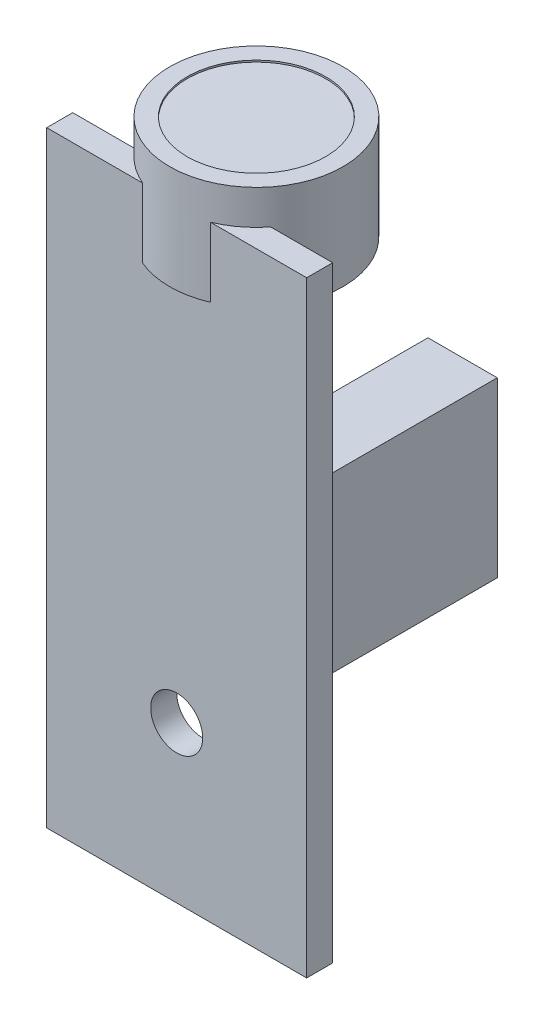
ISO-10303-21;
HEADER;
FILE_DESCRIPTION(('STEP AP214'),'2;1');
FILE_NAME('part.step','',(''),(''),'','','');
FILE_SCHEMA(('AUTOMOTIVE_DESIGN { 1 0 10303 214 1 1 1 1 }'));
ENDSEC;
DATA;
#1=APPLICATION_CONTEXT('core data for automotive mechanical design processes');
#2=APPLICATION_PROTOCOL_DEFINITION('international standard','automotive_design',2000,#1);
#3=PRODUCT_CONTEXT('',#1,'mechanical');
#4=PRODUCT('Part','Part','',(#3));
#5=PRODUCT_RELATED_PRODUCT_CATEGORY('part','',(#4));
#6=PRODUCT_DEFINITION_FORMATION('','',#4);
#7=PRODUCT_DEFINITION_CONTEXT('part definition',#1,'design');
#8=PRODUCT_DEFINITION('design','',#6,#7);
#9=PRODUCT_DEFINITION_SHAPE('','',#8);
#10=(LENGTH_UNIT() NAMED_UNIT(*) SI_UNIT(.MILLI.,.METRE.));
#11=(NAMED_UNIT(*) PLANE_ANGLE_UNIT() SI_UNIT($,.RADIAN.));
#12=(NAMED_UNIT(*) SI_UNIT($,.STERADIAN.) SOLID_ANGLE_UNIT());
#13=UNCERTAINTY_MEASURE_WITH_UNIT(LENGTH_MEASURE(1.E-05),#10,'distance_accuracy_value','');
#14=(GEOMETRIC_REPRESENTATION_CONTEXT(3) GLOBAL_UNCERTAINTY_ASSIGNED_CONTEXT((#13)) GLOBAL_UNIT_ASSIGNED_CONTEXT((#10,
#11,#12)) REPRESENTATION_CONTEXT('',''));
#15=CARTESIAN_POINT('',(0.,0.,0.));
#16=DIRECTION('',(0.,0.,1.));
#17=DIRECTION('',(1.,0.,0.));
#18=AXIS2_PLACEMENT_3D('',#15,#16,#17);
#19=CARTESIAN_POINT('',(0.,0.,0.));
#20=DIRECTION('',(0.,0.,-1.));
#21=DIRECTION('',(-1.,0.,0.));
#22=AXIS2_PLACEMENT_3D('',#19,#20,#21);
#23=PLANE('',#22);
#24=DIRECTION('',(0.,1.,0.));
#25=VECTOR('',#24,1.);
#26=CARTESIAN_POINT('',(216.212225932465,165.394136477233,0.));
#27=LINE('',#26,#25);
#28=CARTESIAN_POINT('',(216.212225932465,165.394136477233,0.));
#29=VERTEX_POINT('',#28);
#30=CARTESIAN_POINT('',(216.212225932465,169.394136477233,0.));
#31=VERTEX_POINT('',#30);
#32=EDGE_CURVE('E55',#29,#31,#27,.T.);
#33=ORIENTED_EDGE('',*,*,#32,.F.);
#34=DIRECTION('',(1.,0.,0.));
#35=VECTOR('',#34,1.);
#36=CARTESIAN_POINT('',(0.,165.394136477233,0.));
#37=LINE('',#36,#35);
#38=CARTESIAN_POINT('',(224.058244030838,165.394136477233,0.));
#39=VERTEX_POINT('',#38);
#40=EDGE_CURVE('E11',#29,#39,#37,.T.);
#41=ORIENTED_EDGE('',*,*,#40,.T.);
#42=DIRECTION('',(0.,1.,0.));
#43=VECTOR('',#42,1.);
#44=CARTESIAN_POINT('',(224.058244030838,165.394136477233,0.));
#45=LINE('',#44,#43);
#46=CARTESIAN_POINT('',(224.058244030838,169.394136477233,0.));
#47=VERTEX_POINT('',#46);
#48=EDGE_CURVE('E168',#47,#39,#45,.F.);
#49=ORIENTED_EDGE('',*,*,#48,.F.);
#50=DIRECTION('',(-1.,0.,0.));
#51=VECTOR('',#50,1.);
#52=CARTESIAN_POINT('',(212.635234981651,169.394136477233,0.));
#53=LINE('',#52,#51);
#54=CARTESIAN_POINT('',(227.635234981651,169.394136477233,0.));
#55=VERTEX_POINT('',#54);
#56=EDGE_CURVE('E186',#55,#47,#53,.T.);
#57=ORIENTED_EDGE('',*,*,#56,.F.);
#58=DIRECTION('',(0.,1.,0.));
#59=VECTOR('',#58,1.);
#60=CARTESIAN_POINT('',(227.635234981651,134.394136477233,0.));
#61=LINE('',#60,#59);
#62=CARTESIAN_POINT('',(227.635234981651,134.394136477233,0.));
#63=VERTEX_POINT('',#62);
#64=EDGE_CURVE('E199',#63,#55,#61,.T.);
#65=ORIENTED_EDGE('',*,*,#64,.F.);
#66=DIRECTION('',(1.,0.,0.));
#67=VECTOR('',#66,1.);
#68=CARTESIAN_POINT('',(212.635234981651,134.394136477233,0.));
#69=LINE('',#68,#67);
#70=CARTESIAN_POINT('',(212.635234981651,134.394136477233,0.));
#71=VERTEX_POINT('',#70);
#72=EDGE_CURVE('E197',#71,#63,#69,.T.);
#73=ORIENTED_EDGE('',*,*,#72,.F.);
#74=DIRECTION('',(0.,-1.,0.));
#75=VECTOR('',#74,1.);
#76=CARTESIAN_POINT('',(212.635234981651,134.394136477233,0.));
#77=LINE('',#76,#75);
#78=CARTESIAN_POINT('',(212.635234981651,169.394136477233,0.));
#79=VERTEX_POINT('',#78);
#80=EDGE_CURVE('E179',#79,#71,#77,.T.);
#81=ORIENTED_EDGE('',*,*,#80,.F.);
#82=EDGE_CURVE('E201',#31,#79,#53,.T.);
#83=ORIENTED_EDGE('',*,*,#82,.F.);
#84=EDGE_LOOP('',(#33,#41,#49,#57,#65,#73,#81,#83));
#85=FACE_BOUND('',#84,.T.);
#86=CARTESIAN_POINT('',(220.135234981651,143.394136477233,0.));
#87=DIRECTION('',(0.,0.,1.));
#88=DIRECTION('',(1.,0.,0.));
#89=AXIS2_PLACEMENT_3D('',#86,#87,#88);
#90=CIRCLE('',#89,1.5);
#91=CARTESIAN_POINT('',(221.635234981651,143.394136477233,0.));
#92=VERTEX_POINT('',#91);
#93=EDGE_CURVE('E175',#92,#92,#90,.T.);
#94=ORIENTED_EDGE('',*,*,#93,.T.);
#95=EDGE_LOOP('',(#94));
#96=FACE_BOUND('',#95,.T.);
#97=DIRECTION('',(-1.,0.,0.));
#98=VECTOR('',#97,1.);
#99=CARTESIAN_POINT('',(227.135234981651,148.394136477233,0.));
#100=LINE('',#99,#98);
#101=CARTESIAN_POINT('',(227.135234981651,148.394136477233,0.));
#102=VERTEX_POINT('',#101);
#103=CARTESIAN_POINT('',(223.135234981651,148.394136477233,0.));
#104=VERTEX_POINT('',#103);
#105=EDGE_CURVE('E418',#102,#104,#100,.T.);
#106=ORIENTED_EDGE('',*,*,#105,.F.);
#107=DIRECTION('',(0.,-1.,0.));
#108=VECTOR('',#107,1.);
#109=CARTESIAN_POINT('',(227.135234981651,158.394136477233,0.));
#110=LINE('',#109,#108);
#111=CARTESIAN_POINT('',(227.135234981651,158.394136477233,0.));
#112=VERTEX_POINT('',#111);
#113=EDGE_CURVE('E145',#112,#102,#110,.T.);
#114=ORIENTED_EDGE('',*,*,#113,.F.);
#115=DIRECTION('',(1.,0.,0.));
#116=VECTOR('',#115,1.);
#117=CARTESIAN_POINT('',(227.135234981651,158.394136477233,0.));
#118=LINE('',#117,#116);
#119=CARTESIAN_POINT('',(223.135234981651,158.394136477233,0.));
#120=VERTEX_POINT('',#119);
#121=EDGE_CURVE('E141',#120,#112,#118,.T.);
#122=ORIENTED_EDGE('',*,*,#121,.F.);
#123=DIRECTION('',(0.,1.,0.));
#124=VECTOR('',#123,1.);
#125=CARTESIAN_POINT('',(223.135234981651,158.394136477233,0.));
#126=LINE('',#125,#124);
#127=EDGE_CURVE('E415',#104,#120,#126,.T.);
#128=ORIENTED_EDGE('',*,*,#127,.F.);
#129=EDGE_LOOP('',(#106,#114,#122,#128));
#130=FACE_BOUND('',#129,.T.);
#131=ADVANCED_FACE('F32',(#85,#96,#130),#23,.T.);
#132=CARTESIAN_POINT('',(212.635234981651,169.394136477233,1.5));
#133=DIRECTION('',(0.,-1.,0.));
#134=DIRECTION('',(0.,0.,-1.));
#135=AXIS2_PLACEMENT_3D('',#132,#133,#134);
#136=PLANE('',#135);
#137=ORIENTED_EDGE('',*,*,#56,.T.);
#138=CARTESIAN_POINT('',(220.135234981651,169.394136477233,-3.1));
#139=DIRECTION('',(0.,-1.,0.));
#140=DIRECTION('',(0.,0.,-1.));
#141=AXIS2_PLACEMENT_3D('',#138,#139,#140);
#142=CIRCLE('',#141,4.99999999999999);
#143=CARTESIAN_POINT('',(222.094826775878,169.394136477233,1.5));
#144=VERTEX_POINT('',#143);
#145=EDGE_CURVE('E40',#47,#144,#142,.T.);
#146=ORIENTED_EDGE('',*,*,#145,.T.);
#147=DIRECTION('',(-1.,0.,0.));
#148=VECTOR('',#147,1.);
#149=CARTESIAN_POINT('',(212.635234981651,169.394136477233,1.5));
#150=LINE('',#149,#148);
#151=CARTESIAN_POINT('',(227.635234981651,169.394136477233,1.5));
#152=VERTEX_POINT('',#151);
#153=EDGE_CURVE('E191',#152,#144,#150,.T.);
#154=ORIENTED_EDGE('',*,*,#153,.F.);
#155=DIRECTION('',(0.,0.,-1.));
#156=VECTOR('',#155,1.);
#157=CARTESIAN_POINT('',(227.635234981651,169.394136477233,1.5));
#158=LINE('',#157,#156);
#159=EDGE_CURVE('E206',#152,#55,#158,.T.);
#160=ORIENTED_EDGE('',*,*,#159,.T.);
#161=EDGE_LOOP('',(#137,#146,#154,#160));
#162=FACE_BOUND('',#161,.T.);
#163=ADVANCED_FACE('F221',(#162),#136,.F.);
#164=CARTESIAN_POINT('',(0.,0.,1.5));
#165=DIRECTION('',(0.,0.,-1.));
#166=DIRECTION('',(-1.,0.,0.));
#167=AXIS2_PLACEMENT_3D('',#164,#165,#166);
#168=PLANE('',#167);
#169=DIRECTION('',(1.,0.,0.));
#170=VECTOR('',#169,1.);
#171=CARTESIAN_POINT('',(0.,165.394136477233,1.5));
#172=LINE('',#171,#170);
#173=CARTESIAN_POINT('',(218.175643187425,165.394136477233,1.5));
#174=VERTEX_POINT('',#173);
#175=CARTESIAN_POINT('',(222.094826775878,165.394136477233,1.5));
#176=VERTEX_POINT('',#175);
#177=EDGE_CURVE('E173',#174,#176,#172,.T.);
#178=ORIENTED_EDGE('',*,*,#177,.F.);
#179=DIRECTION('',(0.,1.,0.));
#180=VECTOR('',#179,1.);
#181=CARTESIAN_POINT('',(218.175643187425,165.394136477233,1.5));
#182=LINE('',#181,#180);
#183=CARTESIAN_POINT('',(218.175643187425,169.394136477233,1.5));
#184=VERTEX_POINT('',#183);
#185=EDGE_CURVE('E165',#174,#184,#182,.T.);
#186=ORIENTED_EDGE('',*,*,#185,.T.);
#187=CARTESIAN_POINT('',(212.635234981651,169.394136477233,1.5));
#188=VERTEX_POINT('',#187);
#189=EDGE_CURVE('E190',#184,#188,#150,.T.);
#190=ORIENTED_EDGE('',*,*,#189,.T.);
#191=DIRECTION('',(0.,-1.,0.));
#192=VECTOR('',#191,1.);
#193=CARTESIAN_POINT('',(212.635234981651,134.394136477233,1.5));
#194=LINE('',#193,#192);
#195=CARTESIAN_POINT('',(212.635234981651,134.394136477233,1.5));
#196=VERTEX_POINT('',#195);
#197=EDGE_CURVE('E182',#188,#196,#194,.T.);
#198=ORIENTED_EDGE('',*,*,#197,.T.);
#199=DIRECTION('',(1.,0.,0.));
#200=VECTOR('',#199,1.);
#201=CARTESIAN_POINT('',(212.635234981651,134.394136477233,1.5));
#202=LINE('',#201,#200);
#203=CARTESIAN_POINT('',(227.635234981651,134.394136477233,1.5));
#204=VERTEX_POINT('',#203);
#205=EDGE_CURVE('E185',#196,#204,#202,.T.);
#206=ORIENTED_EDGE('',*,*,#205,.T.);
#207=DIRECTION('',(0.,1.,0.));
#208=VECTOR('',#207,1.);
#209=CARTESIAN_POINT('',(227.635234981651,134.394136477233,1.5));
#210=LINE('',#209,#208);
#211=EDGE_CURVE('E188',#204,#152,#210,.T.);
#212=ORIENTED_EDGE('',*,*,#211,.T.);
#213=ORIENTED_EDGE('',*,*,#153,.T.);
#214=DIRECTION('',(0.,1.,0.));
#215=VECTOR('',#214,1.);
#216=CARTESIAN_POINT('',(222.094826775878,165.394136477233,1.5));
#217=LINE('',#216,#215);
#218=EDGE_CURVE('E170',#144,#176,#217,.F.);
#219=ORIENTED_EDGE('',*,*,#218,.T.);
#220=EDGE_LOOP('',(#178,#186,#190,#198,#206,#212,#213,#219));
#221=FACE_BOUND('',#220,.T.);
#222=CARTESIAN_POINT('',(220.135234981651,143.394136477233,1.5));
#223=DIRECTION('',(0.,0.,1.));
#224=DIRECTION('',(1.,0.,0.));
#225=AXIS2_PLACEMENT_3D('',#222,#223,#224);
#226=CIRCLE('',#225,1.5);
#227=CARTESIAN_POINT('',(221.635234981651,143.394136477233,1.5));
#228=VERTEX_POINT('',#227);
#229=EDGE_CURVE('E176',#228,#228,#226,.T.);
#230=ORIENTED_EDGE('',*,*,#229,.F.);
#231=EDGE_LOOP('',(#230));
#232=FACE_BOUND('',#231,.T.);
#233=ADVANCED_FACE('F226',(#221,#232),#168,.F.);
#234=CARTESIAN_POINT('',(212.635234981651,134.394136477233,1.5));
#235=DIRECTION('',(1.,0.,0.));
#236=DIRECTION('',(0.,0.,-1.));
#237=AXIS2_PLACEMENT_3D('',#234,#235,#236);
#238=PLANE('',#237);
#239=ORIENTED_EDGE('',*,*,#80,.T.);
#240=DIRECTION('',(0.,0.,-1.));
#241=VECTOR('',#240,1.);
#242=CARTESIAN_POINT('',(212.635234981651,134.394136477233,1.5));
#243=LINE('',#242,#241);
#244=EDGE_CURVE('E212',#196,#71,#243,.T.);
#245=ORIENTED_EDGE('',*,*,#244,.F.);
#246=ORIENTED_EDGE('',*,*,#197,.F.);
#247=DIRECTION('',(0.,0.,-1.));
#248=VECTOR('',#247,1.);
#249=CARTESIAN_POINT('',(212.635234981651,169.394136477233,1.5));
#250=LINE('',#249,#248);
#251=EDGE_CURVE('E194',#188,#79,#250,.T.);
#252=ORIENTED_EDGE('',*,*,#251,.T.);
#253=EDGE_LOOP('',(#239,#245,#246,#252));
#254=FACE_BOUND('',#253,.T.);
#255=ADVANCED_FACE('F34',(#254),#238,.F.);
#256=CARTESIAN_POINT('',(212.635234981651,134.394136477233,1.5));
#257=DIRECTION('',(0.,1.,0.));
#258=DIRECTION('',(0.,0.,1.));
#259=AXIS2_PLACEMENT_3D('',#256,#257,#258);
#260=PLANE('',#259);
#261=ORIENTED_EDGE('',*,*,#72,.T.);
#262=DIRECTION('',(0.,0.,-1.));
#263=VECTOR('',#262,1.);
#264=CARTESIAN_POINT('',(227.635234981651,134.394136477233,1.5));
#265=LINE('',#264,#263);
#266=EDGE_CURVE('E209',#204,#63,#265,.T.);
#267=ORIENTED_EDGE('',*,*,#266,.F.);
#268=ORIENTED_EDGE('',*,*,#205,.F.);
#269=ORIENTED_EDGE('',*,*,#244,.T.);
#270=EDGE_LOOP('',(#261,#267,#268,#269));
#271=FACE_BOUND('',#270,.T.);
#272=ADVANCED_FACE('F268',(#271),#260,.F.);
#273=CARTESIAN_POINT('',(227.635234981651,134.394136477233,1.5));
#274=DIRECTION('',(-1.,0.,0.));
#275=DIRECTION('',(0.,0.,1.));
#276=AXIS2_PLACEMENT_3D('',#273,#274,#275);
#277=PLANE('',#276);
#278=ORIENTED_EDGE('',*,*,#64,.T.);
#279=ORIENTED_EDGE('',*,*,#159,.F.);
#280=ORIENTED_EDGE('',*,*,#211,.F.);
#281=ORIENTED_EDGE('',*,*,#266,.T.);
#282=EDGE_LOOP('',(#278,#279,#280,#281));
#283=FACE_BOUND('',#282,.T.);
#284=ADVANCED_FACE('F232',(#283),#277,.F.);
#285=ORIENTED_EDGE('',*,*,#189,.F.);
#286=EDGE_CURVE('E214',#184,#31,#142,.T.);
#287=ORIENTED_EDGE('',*,*,#286,.T.);
#288=ORIENTED_EDGE('',*,*,#82,.T.);
#289=ORIENTED_EDGE('',*,*,#251,.F.);
#290=EDGE_LOOP('',(#285,#287,#288,#289));
#291=FACE_BOUND('',#290,.T.);
#292=ADVANCED_FACE('F262',(#291),#136,.F.);
#293=CARTESIAN_POINT('',(220.135234981651,143.394136477233,1.5));
#294=DIRECTION('',(0.,0.,-1.));
#295=DIRECTION('',(-1.,0.,0.));
#296=AXIS2_PLACEMENT_3D('',#293,#294,#295);
#297=CYLINDRICAL_SURFACE('',#296,1.5);
#298=ORIENTED_EDGE('',*,*,#229,.T.);
#299=EDGE_LOOP('',(#298));
#300=FACE_BOUND('',#299,.T.);
#301=ORIENTED_EDGE('',*,*,#93,.F.);
#302=EDGE_LOOP('',(#301));
#303=FACE_BOUND('',#302,.T.);
#304=ADVANCED_FACE('F254',(#300,#303),#297,.F.);
#305=CARTESIAN_POINT('',(220.135234981651,165.394136477233,-3.1));
#306=DIRECTION('',(0.,1.,0.));
#307=DIRECTION('',(0.,0.,1.));
#308=AXIS2_PLACEMENT_3D('',#305,#306,#307);
#309=PLANE('',#308);
#310=CARTESIAN_POINT('',(220.135234981651,165.394136477233,-3.1));
#311=DIRECTION('',(0.,1.,0.));
#312=DIRECTION('',(0.,0.,1.));
#313=AXIS2_PLACEMENT_3D('',#310,#311,#312);
#314=CIRCLE('',#313,4.99999999999999);
#315=EDGE_CURVE('E160',#174,#176,#314,.T.);
#316=ORIENTED_EDGE('',*,*,#315,.F.);
#317=ORIENTED_EDGE('',*,*,#177,.T.);
#318=EDGE_LOOP('',(#316,#317));
#319=FACE_BOUND('',#318,.T.);
#320=ADVANCED_FACE('F243',(#319),#309,.F.);
#321=CARTESIAN_POINT('',(220.135234981651,165.394136477233,-3.1));
#322=DIRECTION('',(0.,1.,0.));
#323=DIRECTION('',(0.,0.,1.));
#324=AXIS2_PLACEMENT_3D('',#321,#322,#323);
#325=CYLINDRICAL_SURFACE('',#324,4.99999999999999);
#326=CARTESIAN_POINT('',(220.135234981651,171.394136477233,-3.1));
#327=DIRECTION('',(0.,1.,0.));
#328=DIRECTION('',(0.,0.,1.));
#329=AXIS2_PLACEMENT_3D('',#326,#327,#328);
#330=CIRCLE('',#329,4.99999999999999);
#331=CARTESIAN_POINT('',(220.135234981651,171.394136477233,1.89999999999999));
#332=VERTEX_POINT('',#331);
#333=EDGE_CURVE('E156',#332,#332,#330,.T.);
#334=ORIENTED_EDGE('',*,*,#333,.F.);
#335=EDGE_LOOP('',(#334));
#336=FACE_BOUND('',#335,.T.);
#337=ORIENTED_EDGE('',*,*,#218,.F.);
#338=ORIENTED_EDGE('',*,*,#145,.F.);
#339=ORIENTED_EDGE('',*,*,#48,.T.);
#340=EDGE_CURVE('E163',#39,#29,#314,.T.);
#341=ORIENTED_EDGE('',*,*,#340,.T.);
#342=ORIENTED_EDGE('',*,*,#32,.T.);
#343=ORIENTED_EDGE('',*,*,#286,.F.);
#344=ORIENTED_EDGE('',*,*,#185,.F.);
#345=ORIENTED_EDGE('',*,*,#315,.T.);
#346=EDGE_LOOP('',(#337,#338,#339,#341,#342,#343,#344,#345));
#347=FACE_BOUND('',#346,.T.);
#348=ADVANCED_FACE('F237',(#336,#347),#325,.T.);
#349=ORIENTED_EDGE('',*,*,#40,.F.);
#350=ORIENTED_EDGE('',*,*,#340,.F.);
#351=EDGE_LOOP('',(#349,#350));
#352=FACE_BOUND('',#351,.T.);
#353=ADVANCED_FACE('F239',(#352),#309,.F.);
#354=CARTESIAN_POINT('',(220.135234981651,171.394136477233,-3.1));
#355=DIRECTION('',(0.,1.,0.));
#356=DIRECTION('',(0.,0.,1.));
#357=AXIS2_PLACEMENT_3D('',#354,#355,#356);
#358=PLANE('',#357);
#359=CARTESIAN_POINT('',(220.135234981651,171.394136477233,-3.1));
#360=DIRECTION('',(0.,1.,0.));
#361=DIRECTION('',(0.,0.,1.));
#362=AXIS2_PLACEMENT_3D('',#359,#360,#361);
#363=CIRCLE('',#362,3.99999999999999);
#364=CARTESIAN_POINT('',(220.135234981651,171.394136477233,0.899999999999992));
#365=VERTEX_POINT('',#364);
#366=EDGE_CURVE('E147',#365,#365,#363,.T.);
#367=ORIENTED_EDGE('',*,*,#366,.F.);
#368=EDGE_LOOP('',(#367));
#369=FACE_BOUND('',#368,.T.);
#370=ORIENTED_EDGE('',*,*,#333,.T.);
#371=EDGE_LOOP('',(#370));
#372=FACE_BOUND('',#371,.T.);
#373=ADVANCED_FACE('F241',(#369,#372),#358,.T.);
#374=CARTESIAN_POINT('',(220.135234981651,171.294136477233,-3.1));
#375=DIRECTION('',(0.,1.,0.));
#376=DIRECTION('',(0.,0.,1.));
#377=AXIS2_PLACEMENT_3D('',#374,#375,#376);
#378=CYLINDRICAL_SURFACE('',#377,3.99999999999999);
#379=CARTESIAN_POINT('',(220.135234981651,171.294136477233,-3.1));
#380=DIRECTION('',(0.,1.,0.));
#381=DIRECTION('',(0.,0.,1.));
#382=AXIS2_PLACEMENT_3D('',#379,#380,#381);
#383=CIRCLE('',#382,3.99999999999999);
#384=CARTESIAN_POINT('',(220.135234981651,171.294136477233,0.899999999999992));
#385=VERTEX_POINT('',#384);
#386=EDGE_CURVE('E150',#385,#385,#383,.T.);
#387=ORIENTED_EDGE('',*,*,#386,.F.);
#388=EDGE_LOOP('',(#387));
#389=FACE_BOUND('',#388,.T.);
#390=ORIENTED_EDGE('',*,*,#366,.T.);
#391=EDGE_LOOP('',(#390));
#392=FACE_BOUND('',#391,.T.);
#393=ADVANCED_FACE('F248',(#389,#392),#378,.F.);
#394=CARTESIAN_POINT('',(220.135234981651,171.294136477233,-3.1));
#395=DIRECTION('',(0.,1.,0.));
#396=DIRECTION('',(0.,0.,1.));
#397=AXIS2_PLACEMENT_3D('',#394,#395,#396);
#398=PLANE('',#397);
#399=ORIENTED_EDGE('',*,*,#386,.T.);
#400=EDGE_LOOP('',(#399));
#401=FACE_BOUND('',#400,.T.);
#402=ADVANCED_FACE('F350',(#401),#398,.T.);
#403=CARTESIAN_POINT('',(227.135234981651,158.394136477233,-10.));
#404=DIRECTION('',(-1.,0.,0.));
#405=DIRECTION('',(0.,0.,1.));
#406=AXIS2_PLACEMENT_3D('',#403,#404,#405);
#407=PLANE('',#406);
#408=ORIENTED_EDGE('',*,*,#113,.T.);
#409=DIRECTION('',(0.,0.,1.));
#410=VECTOR('',#409,1.);
#411=CARTESIAN_POINT('',(227.135234981651,148.394136477233,-10.));
#412=LINE('',#411,#410);
#413=CARTESIAN_POINT('',(227.135234981651,148.394136477233,-10.));
#414=VERTEX_POINT('',#413);
#415=EDGE_CURVE('E126',#414,#102,#412,.T.);
#416=ORIENTED_EDGE('',*,*,#415,.F.);
#417=DIRECTION('',(0.,-1.,0.));
#418=VECTOR('',#417,1.);
#419=CARTESIAN_POINT('',(227.135234981651,158.394136477233,-10.));
#420=LINE('',#419,#418);
#421=CARTESIAN_POINT('',(227.135234981651,158.394136477233,-10.));
#422=VERTEX_POINT('',#421);
#423=EDGE_CURVE('E133',#422,#414,#420,.T.);
#424=ORIENTED_EDGE('',*,*,#423,.F.);
#425=DIRECTION('',(0.,0.,1.));
#426=VECTOR('',#425,1.);
#427=CARTESIAN_POINT('',(227.135234981651,158.394136477233,-10.));
#428=LINE('',#427,#426);
#429=EDGE_CURVE('E412',#422,#112,#428,.T.);
#430=ORIENTED_EDGE('',*,*,#429,.T.);
#431=EDGE_LOOP('',(#408,#416,#424,#430));
#432=FACE_BOUND('',#431,.T.);
#433=ADVANCED_FACE('F143',(#432),#407,.F.);
#434=CARTESIAN_POINT('',(227.135234981651,148.394136477233,-10.));
#435=DIRECTION('',(0.,1.,0.));
#436=DIRECTION('',(0.,0.,1.));
#437=AXIS2_PLACEMENT_3D('',#434,#435,#436);
#438=PLANE('',#437);
#439=ORIENTED_EDGE('',*,*,#105,.T.);
#440=DIRECTION('',(0.,0.,1.));
#441=VECTOR('',#440,1.);
#442=CARTESIAN_POINT('',(223.135234981651,148.394136477233,-10.));
#443=LINE('',#442,#441);
#444=CARTESIAN_POINT('',(223.135234981651,148.394136477233,-10.));
#445=VERTEX_POINT('',#444);
#446=EDGE_CURVE('E129',#445,#104,#443,.T.);
#447=ORIENTED_EDGE('',*,*,#446,.F.);
#448=DIRECTION('',(-1.,0.,0.));
#449=VECTOR('',#448,1.);
#450=CARTESIAN_POINT('',(227.135234981651,148.394136477233,-10.));
#451=LINE('',#450,#449);
#452=EDGE_CURVE('E122',#414,#445,#451,.T.);
#453=ORIENTED_EDGE('',*,*,#452,.F.);
#454=ORIENTED_EDGE('',*,*,#415,.T.);
#455=EDGE_LOOP('',(#439,#447,#453,#454));
#456=FACE_BOUND('',#455,.T.);
#457=ADVANCED_FACE('F124',(#456),#438,.F.);
#458=CARTESIAN_POINT('',(223.135234981651,158.394136477233,-10.));
#459=DIRECTION('',(1.,0.,0.));
#460=DIRECTION('',(0.,0.,-1.));
#461=AXIS2_PLACEMENT_3D('',#458,#459,#460);
#462=PLANE('',#461);
#463=ORIENTED_EDGE('',*,*,#127,.T.);
#464=DIRECTION('',(0.,0.,1.));
#465=VECTOR('',#464,1.);
#466=CARTESIAN_POINT('',(223.135234981651,158.394136477233,-10.));
#467=LINE('',#466,#465);
#468=CARTESIAN_POINT('',(223.135234981651,158.394136477233,-10.));
#469=VERTEX_POINT('',#468);
#470=EDGE_CURVE('E47',#469,#120,#467,.T.);
#471=ORIENTED_EDGE('',*,*,#470,.F.);
#472=DIRECTION('',(0.,1.,0.));
#473=VECTOR('',#472,1.);
#474=CARTESIAN_POINT('',(223.135234981651,158.394136477233,-10.));
#475=LINE('',#474,#473);
#476=EDGE_CURVE('E132',#445,#469,#475,.T.);
#477=ORIENTED_EDGE('',*,*,#476,.F.);
#478=ORIENTED_EDGE('',*,*,#446,.T.);
#479=EDGE_LOOP('',(#463,#471,#477,#478));
#480=FACE_BOUND('',#479,.T.);
#481=ADVANCED_FACE('F381',(#480),#462,.F.);
#482=CARTESIAN_POINT('',(227.135234981651,158.394136477233,-10.));
#483=DIRECTION('',(0.,-1.,0.));
#484=DIRECTION('',(0.,0.,-1.));
#485=AXIS2_PLACEMENT_3D('',#482,#483,#484);
#486=PLANE('',#485);
#487=ORIENTED_EDGE('',*,*,#121,.T.);
#488=ORIENTED_EDGE('',*,*,#429,.F.);
#489=DIRECTION('',(1.,0.,0.));
#490=VECTOR('',#489,1.);
#491=CARTESIAN_POINT('',(227.135234981651,158.394136477233,-10.));
#492=LINE('',#491,#490);
#493=EDGE_CURVE('E137',#469,#422,#492,.T.);
#494=ORIENTED_EDGE('',*,*,#493,.F.);
#495=ORIENTED_EDGE('',*,*,#470,.T.);
#496=EDGE_LOOP('',(#487,#488,#494,#495));
#497=FACE_BOUND('',#496,.T.);
#498=ADVANCED_FACE('F390',(#497),#486,.F.);
#499=CARTESIAN_POINT('',(0.,0.,-10.));
#500=DIRECTION('',(0.,0.,-1.));
#501=DIRECTION('',(-1.,0.,0.));
#502=AXIS2_PLACEMENT_3D('',#499,#500,#501);
#503=PLANE('',#502);
#504=ORIENTED_EDGE('',*,*,#423,.T.);
#505=ORIENTED_EDGE('',*,*,#452,.T.);
#506=ORIENTED_EDGE('',*,*,#476,.T.);
#507=ORIENTED_EDGE('',*,*,#493,.T.);
#508=EDGE_LOOP('',(#504,#505,#506,#507));
#509=FACE_BOUND('',#508,.T.);
#510=ADVANCED_FACE('F136',(#509),#503,.T.);
#511=CLOSED_SHELL('',(#131,#163,#233,#255,#272,#284,#292,#304,#320,#348,#353,#373,#393,#402,
#433,#457,#481,#498,#510));
#512=MANIFOLD_SOLID_BREP('B2',#511);
#513=ADVANCED_BREP_SHAPE_REPRESENTATION('',(#18,#512),#14);
#514=SHAPE_DEFINITION_REPRESENTATION(#9,#513);
ENDSEC;
END-ISO-10303-21;
